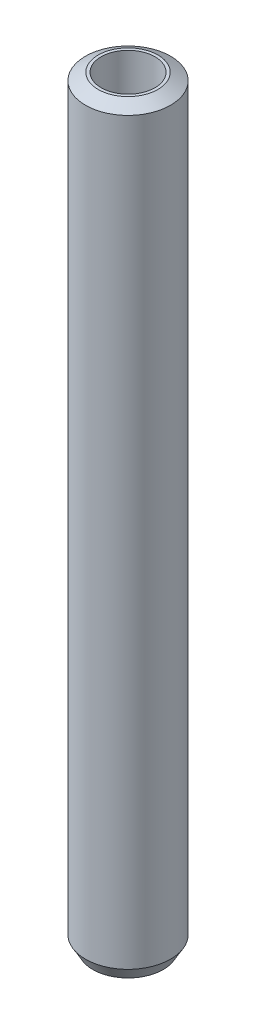
ISO-10303-21;
HEADER;
FILE_DESCRIPTION(('STEP AP214'),'2;1');
FILE_NAME('part.step','',(''),(''),'','','');
FILE_SCHEMA(('AUTOMOTIVE_DESIGN { 1 0 10303 214 1 1 1 1 }'));
ENDSEC;
DATA;
#1=APPLICATION_CONTEXT('core data for automotive mechanical design processes');
#2=APPLICATION_PROTOCOL_DEFINITION('international standard','automotive_design',2000,#1);
#3=PRODUCT_CONTEXT('',#1,'mechanical');
#4=PRODUCT('Part','Part','',(#3));
#5=PRODUCT_RELATED_PRODUCT_CATEGORY('part','',(#4));
#6=PRODUCT_DEFINITION_FORMATION('','',#4);
#7=PRODUCT_DEFINITION_CONTEXT('part definition',#1,'design');
#8=PRODUCT_DEFINITION('design','',#6,#7);
#9=PRODUCT_DEFINITION_SHAPE('','',#8);
#10=(LENGTH_UNIT() NAMED_UNIT(*) SI_UNIT(.MILLI.,.METRE.));
#11=(NAMED_UNIT(*) PLANE_ANGLE_UNIT() SI_UNIT($,.RADIAN.));
#12=(NAMED_UNIT(*) SI_UNIT($,.STERADIAN.) SOLID_ANGLE_UNIT());
#13=UNCERTAINTY_MEASURE_WITH_UNIT(LENGTH_MEASURE(1.E-05),#10,'distance_accuracy_value','');
#14=(GEOMETRIC_REPRESENTATION_CONTEXT(3) GLOBAL_UNCERTAINTY_ASSIGNED_CONTEXT((#13)) GLOBAL_UNIT_ASSIGNED_CONTEXT((#10,
#11,#12)) REPRESENTATION_CONTEXT('',''));
#15=CARTESIAN_POINT('',(0.,0.,0.));
#16=DIRECTION('',(0.,0.,1.));
#17=DIRECTION('',(1.,0.,0.));
#18=AXIS2_PLACEMENT_3D('',#15,#16,#17);
#19=CARTESIAN_POINT('',(0.,446.381429331347,0.));
#20=DIRECTION('',(0.,-1.,0.));
#21=DIRECTION('',(0.,0.,-1.));
#22=AXIS2_PLACEMENT_3D('',#19,#20,#21);
#23=CYLINDRICAL_SURFACE('',#22,25.);
#24=CARTESIAN_POINT('',(0.,442.079619299636,0.));
#25=DIRECTION('',(0.,1.,0.));
#26=DIRECTION('',(0.,0.,1.));
#27=AXIS2_PLACEMENT_3D('',#24,#25,#26);
#28=CIRCLE('',#27,25.);
#29=CARTESIAN_POINT('',(0.,442.079619299636,-25.0000000000001));
#30=VERTEX_POINT('',#29);
#31=EDGE_CURVE('E50',#30,#30,#28,.F.);
#32=ORIENTED_EDGE('',*,*,#31,.T.);
#33=EDGE_LOOP('',(#32));
#34=FACE_BOUND('',#33,.T.);
#35=CARTESIAN_POINT('',(0.,7.45095353943298,0.));
#36=DIRECTION('',(0.,1.,0.));
#37=DIRECTION('',(0.,0.,1.));
#38=AXIS2_PLACEMENT_3D('',#35,#36,#37);
#39=CIRCLE('',#38,25.);
#40=CARTESIAN_POINT('',(0.,7.45095353943298,25.));
#41=VERTEX_POINT('',#40);
#42=EDGE_CURVE('E51',#41,#41,#39,.T.);
#43=ORIENTED_EDGE('',*,*,#42,.T.);
#44=EDGE_LOOP('',(#43));
#45=FACE_BOUND('',#44,.T.);
#46=ADVANCED_FACE('F39',(#34,#45),#23,.T.);
#47=CARTESIAN_POINT('',(0.,446.381429331347,0.));
#48=DIRECTION('',(0.,1.,0.));
#49=DIRECTION('',(0.,0.,1.));
#50=AXIS2_PLACEMENT_3D('',#47,#48,#49);
#51=PLANE('',#50);
#52=CARTESIAN_POINT('',(0.,446.381429331347,0.));
#53=DIRECTION('',(0.,1.,0.));
#54=DIRECTION('',(0.,0.,1.));
#55=AXIS2_PLACEMENT_3D('',#52,#53,#54);
#56=CIRCLE('',#55,17.5490464605669);
#57=CARTESIAN_POINT('',(0.,446.381429331347,-17.5490464605669));
#58=VERTEX_POINT('',#57);
#59=EDGE_CURVE('E54',#58,#58,#56,.T.);
#60=ORIENTED_EDGE('',*,*,#59,.T.);
#61=EDGE_LOOP('',(#60));
#62=FACE_BOUND('',#61,.T.);
#63=CARTESIAN_POINT('',(0.,446.381429331347,0.));
#64=DIRECTION('',(0.,1.,0.));
#65=DIRECTION('',(0.,0.,1.));
#66=AXIS2_PLACEMENT_3D('',#63,#64,#65);
#67=CIRCLE('',#66,15.8136481092998);
#68=CARTESIAN_POINT('',(0.,446.381429331347,15.8136481092998));
#69=VERTEX_POINT('',#68);
#70=EDGE_CURVE('E58',#69,#69,#67,.T.);
#71=ORIENTED_EDGE('',*,*,#70,.F.);
#72=EDGE_LOOP('',(#71));
#73=FACE_BOUND('',#72,.T.);
#74=ADVANCED_FACE('F69',(#62,#73),#51,.T.);
#75=CARTESIAN_POINT('',(0.,0.,0.));
#76=DIRECTION('',(0.,1.,0.));
#77=DIRECTION('',(0.,0.,1.));
#78=AXIS2_PLACEMENT_3D('',#75,#76,#77);
#79=PLANE('',#78);
#80=CARTESIAN_POINT('',(0.,0.,0.));
#81=DIRECTION('',(0.,1.,0.));
#82=DIRECTION('',(0.,0.,1.));
#83=AXIS2_PLACEMENT_3D('',#80,#81,#82);
#84=CIRCLE('',#83,20.698189968289);
#85=CARTESIAN_POINT('',(0.,0.,20.698189968289));
#86=VERTEX_POINT('',#85);
#87=EDGE_CURVE('E10',#86,#86,#84,.F.);
#88=ORIENTED_EDGE('',*,*,#87,.T.);
#89=EDGE_LOOP('',(#88));
#90=FACE_BOUND('',#89,.T.);
#91=CARTESIAN_POINT('',(0.,0.,0.));
#92=DIRECTION('',(0.,1.,0.));
#93=DIRECTION('',(0.,0.,1.));
#94=AXIS2_PLACEMENT_3D('',#91,#92,#93);
#95=CIRCLE('',#94,15.8136481092998);
#96=CARTESIAN_POINT('',(0.,0.,15.8136481092998));
#97=VERTEX_POINT('',#96);
#98=EDGE_CURVE('E63',#97,#97,#95,.T.);
#99=ORIENTED_EDGE('',*,*,#98,.T.);
#100=EDGE_LOOP('',(#99));
#101=FACE_BOUND('',#100,.T.);
#102=ADVANCED_FACE('F75',(#90,#101),#79,.F.);
#103=CARTESIAN_POINT('',(0.,446.381429331347,0.));
#104=DIRECTION('',(0.,-1.,0.));
#105=DIRECTION('',(0.,0.,-1.));
#106=AXIS2_PLACEMENT_3D('',#103,#104,#105);
#107=CYLINDRICAL_SURFACE('',#106,15.8136481092998);
#108=ORIENTED_EDGE('',*,*,#70,.T.);
#109=EDGE_LOOP('',(#108));
#110=FACE_BOUND('',#109,.T.);
#111=ORIENTED_EDGE('',*,*,#98,.F.);
#112=EDGE_LOOP('',(#111));
#113=FACE_BOUND('',#112,.T.);
#114=ADVANCED_FACE('F70',(#110,#113),#107,.F.);
#115=CARTESIAN_POINT('',(0.,446.381429331347,0.));
#116=DIRECTION('',(0.,-1.,0.));
#117=DIRECTION('',(0.,0.,-1.));
#118=AXIS2_PLACEMENT_3D('',#115,#116,#117);
#119=CONICAL_SURFACE('',#118,17.5490464605669,1.0471975511966);
#120=CARTESIAN_POINT('',(0.,442.079619299636,-25.0000000000001));
#121=CARTESIAN_POINT('',(0.,442.124429820799,-24.922385900631));
#122=CARTESIAN_POINT('',(0.,442.169240341963,-24.8447718012619));
#123=CARTESIAN_POINT('',(0.,442.25886138429,-24.6895436025237));
#124=CARTESIAN_POINT('',(0.,442.303671905454,-24.6119295031546));
#125=CARTESIAN_POINT('',(0.,442.393292947781,-24.4567013044164));
#126=CARTESIAN_POINT('',(0.,442.438103468945,-24.3790872050473));
#127=CARTESIAN_POINT('',(0.,442.527724511272,-24.2238590063091));
#128=CARTESIAN_POINT('',(0.,442.572535032436,-24.14624490694));
#129=CARTESIAN_POINT('',(0.,442.662156074763,-23.9910167082018));
#130=CARTESIAN_POINT('',(0.,442.706966595927,-23.9134026088327));
#131=CARTESIAN_POINT('',(0.,442.796587638254,-23.7581744100945));
#132=CARTESIAN_POINT('',(0.,442.841398159418,-23.6805603107254));
#133=CARTESIAN_POINT('',(0.,442.931019201745,-23.5253321119872));
#134=CARTESIAN_POINT('',(0.,442.975829722909,-23.4477180126182));
#135=CARTESIAN_POINT('',(0.,443.065450765236,-23.29248981388));
#136=CARTESIAN_POINT('',(0.,443.1102612864,-23.2148757145109));
#137=CARTESIAN_POINT('',(0.,443.199882328727,-23.0596475157727));
#138=CARTESIAN_POINT('',(0.,443.244692849891,-22.9820334164036));
#139=CARTESIAN_POINT('',(0.,443.334313892218,-22.8268052176654));
#140=CARTESIAN_POINT('',(0.,443.379124413382,-22.7491911182963));
#141=CARTESIAN_POINT('',(0.,443.468745455709,-22.5939629195581));
#142=CARTESIAN_POINT('',(0.,443.513555976873,-22.516348820189));
#143=CARTESIAN_POINT('',(0.,443.6031770192,-22.3611206214508));
#144=CARTESIAN_POINT('',(0.,443.647987540364,-22.2835065220817));
#145=CARTESIAN_POINT('',(0.,443.737608582691,-22.1282783233435));
#146=CARTESIAN_POINT('',(0.,443.782419103855,-22.0506642239744));
#147=CARTESIAN_POINT('',(0.,443.872040146182,-21.8954360252362));
#148=CARTESIAN_POINT('',(0.,443.916850667345,-21.8178219258672));
#149=CARTESIAN_POINT('',(0.,444.006471709673,-21.662593727129));
#150=CARTESIAN_POINT('',(0.,444.051282230836,-21.5849796277599));
#151=CARTESIAN_POINT('',(0.,444.140903273164,-21.4297514290217));
#152=CARTESIAN_POINT('',(0.,444.185713794327,-21.3521373296526));
#153=CARTESIAN_POINT('',(0.,444.275334836655,-21.1969091309144));
#154=CARTESIAN_POINT('',(0.,444.320145357818,-21.1192950315453));
#155=CARTESIAN_POINT('',(0.,444.409766400146,-20.9640668328071));
#156=CARTESIAN_POINT('',(0.,444.454576921309,-20.886452733438));
#157=CARTESIAN_POINT('',(0.,444.544197963637,-20.7312245346998));
#158=CARTESIAN_POINT('',(0.,444.5890084848,-20.6536104353307));
#159=CARTESIAN_POINT('',(0.,444.678629527128,-20.4983822365925));
#160=CARTESIAN_POINT('',(0.,444.723440048291,-20.4207681372234));
#161=CARTESIAN_POINT('',(0.,444.813061090619,-20.2655399384853));
#162=CARTESIAN_POINT('',(0.,444.857871611782,-20.1879258391162));
#163=CARTESIAN_POINT('',(0.,444.94749265411,-20.032697640378));
#164=CARTESIAN_POINT('',(0.,444.992303175273,-19.9550835410089));
#165=CARTESIAN_POINT('',(0.,445.081924217601,-19.7998553422707));
#166=CARTESIAN_POINT('',(0.,445.126734738764,-19.7222412429016));
#167=CARTESIAN_POINT('',(0.,445.216355781092,-19.5670130441634));
#168=CARTESIAN_POINT('',(0.,445.261166302255,-19.4893989447943));
#169=CARTESIAN_POINT('',(0.,445.350787344583,-19.3341707460561));
#170=CARTESIAN_POINT('',(0.,445.395597865746,-19.256556646687));
#171=CARTESIAN_POINT('',(0.,445.485218908074,-19.1013284479488));
#172=CARTESIAN_POINT('',(0.,445.530029429237,-19.0237143485797));
#173=CARTESIAN_POINT('',(0.,445.619650471565,-18.8684861498415));
#174=CARTESIAN_POINT('',(0.,445.664460992728,-18.7908720504724));
#175=CARTESIAN_POINT('',(0.,445.754082035055,-18.6356438517343));
#176=CARTESIAN_POINT('',(0.,445.798892556219,-18.5580297523652));
#177=CARTESIAN_POINT('',(0.,445.888513598546,-18.402801553627));
#178=CARTESIAN_POINT('',(0.,445.93332411971,-18.3251874542579));
#179=CARTESIAN_POINT('',(0.,446.022945162037,-18.1699592555197));
#180=CARTESIAN_POINT('',(0.,446.067755683201,-18.0923451561506));
#181=CARTESIAN_POINT('',(0.,446.157376725528,-17.9371169574124));
#182=CARTESIAN_POINT('',(0.,446.202187246692,-17.8595028580433));
#183=CARTESIAN_POINT('',(0.,446.291808289019,-17.7042746593051));
#184=CARTESIAN_POINT('',(0.,446.336618810183,-17.626660559936));
#185=CARTESIAN_POINT('',(0.,446.381429331347,-17.5490464605669));
#186=B_SPLINE_CURVE_WITH_KNOTS('',3,(#120,#121,#122,#123,#124,#125,#126,#127,#128,#129,#130,
#131,#132,#133,#134,#135,#136,#137,#138,#139,#140,#141,#142,#143,#144,#145,#146,#147,#148,#149,
#150,#151,#152,#153,#154,#155,#156,#157,#158,#159,#160,#161,#162,#163,#164,#165,#166,#167,#168,
#169,#170,#171,#172,#173,#174,#175,#176,#177,#178,#179,#180,#181,#182,#183,#184,#185),
.UNSPECIFIED.,.F.,.F.,(4,2,2,2,2,2,2,2,2,2,2,2,2,2,2,2,2,2,2,2,2,2,2,2,2,2,2,2,2,2,2,2,4),(0.,
0.26886312698197,0.537726253963912,0.806589380945851,1.07545250792779,1.34431563490974,
1.61317876189168,1.88204188887362,2.15090501585556,2.4197681428375,2.68863126981945,
2.95749439680142,3.22635752378336,3.4952206507653,3.76408377774724,4.03294690472918,
4.30181003171112,4.57067315869306,4.839536285675,5.10839941265695,5.37726253963889,
5.64612566662083,5.9149887936028,6.18385192058474,6.45271504756668,6.72157817454862,
6.99044130153056,7.25930442851251,7.52816755549445,7.79703068247639,8.06589380945833,
8.33475693644027,8.60362006342224),.UNSPECIFIED.);
#187=EDGE_CURVE('BSEAM81',#30,#58,#186,.T.);
#188=ORIENTED_EDGE('',*,*,#31,.F.);
#189=ORIENTED_EDGE('',*,*,#59,.F.);
#190=ORIENTED_EDGE('',*,*,#187,.T.);
#191=ORIENTED_EDGE('',*,*,#187,.F.);
#192=EDGE_LOOP('',(#188,#190,#189,#191));
#193=FACE_BOUND('',#192,.T.);
#194=ADVANCED_FACE('F81',(#193),#119,.T.);
#195=CARTESIAN_POINT('',(0.,7.45095353943298,0.));
#196=DIRECTION('',(0.,1.,0.));
#197=DIRECTION('',(0.,0.,1.));
#198=AXIS2_PLACEMENT_3D('',#195,#196,#197);
#199=CONICAL_SURFACE('',#198,25.,0.523598775598301);
#200=ORIENTED_EDGE('',*,*,#87,.F.);
#201=EDGE_LOOP('',(#200));
#202=FACE_BOUND('',#201,.T.);
#203=ORIENTED_EDGE('',*,*,#42,.F.);
#204=EDGE_LOOP('',(#203));
#205=FACE_BOUND('',#204,.T.);
#206=ADVANCED_FACE('F45',(#202,#205),#199,.T.);
#207=CLOSED_SHELL('',(#46,#74,#102,#114,#194,#206));
#208=MANIFOLD_SOLID_BREP('B2',#207);
#209=ADVANCED_BREP_SHAPE_REPRESENTATION('',(#18,#208),#14);
#210=SHAPE_DEFINITION_REPRESENTATION(#9,#209);
ENDSEC;
END-ISO-10303-21;
